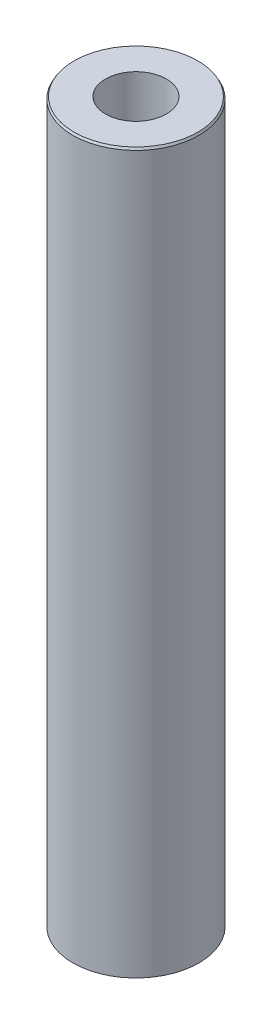
ISO-10303-21;
HEADER;
FILE_DESCRIPTION(('STEP AP214'),'2;1');
FILE_NAME('part.step','',(''),(''),'','','');
FILE_SCHEMA(('AUTOMOTIVE_DESIGN { 1 0 10303 214 1 1 1 1 }'));
ENDSEC;
DATA;
#1=APPLICATION_CONTEXT('core data for automotive mechanical design processes');
#2=APPLICATION_PROTOCOL_DEFINITION('international standard','automotive_design',2000,#1);
#3=PRODUCT_CONTEXT('',#1,'mechanical');
#4=PRODUCT('Part','Part','',(#3));
#5=PRODUCT_RELATED_PRODUCT_CATEGORY('part','',(#4));
#6=PRODUCT_DEFINITION_FORMATION('','',#4);
#7=PRODUCT_DEFINITION_CONTEXT('part definition',#1,'design');
#8=PRODUCT_DEFINITION('design','',#6,#7);
#9=PRODUCT_DEFINITION_SHAPE('','',#8);
#10=(LENGTH_UNIT() NAMED_UNIT(*) SI_UNIT(.MILLI.,.METRE.));
#11=(NAMED_UNIT(*) PLANE_ANGLE_UNIT() SI_UNIT($,.RADIAN.));
#12=(NAMED_UNIT(*) SI_UNIT($,.STERADIAN.) SOLID_ANGLE_UNIT());
#13=UNCERTAINTY_MEASURE_WITH_UNIT(LENGTH_MEASURE(1.E-05),#10,'distance_accuracy_value','');
#14=(GEOMETRIC_REPRESENTATION_CONTEXT(3) GLOBAL_UNCERTAINTY_ASSIGNED_CONTEXT((#13)) GLOBAL_UNIT_ASSIGNED_CONTEXT((#10,
#11,#12)) REPRESENTATION_CONTEXT('',''));
#15=CARTESIAN_POINT('',(0.,0.,0.));
#16=DIRECTION('',(0.,0.,1.));
#17=DIRECTION('',(1.,0.,0.));
#18=AXIS2_PLACEMENT_3D('',#15,#16,#17);
#19=CARTESIAN_POINT('',(0.,513.737910442329,0.));
#20=DIRECTION('',(0.,-1.,0.));
#21=DIRECTION('',(0.,0.,-1.));
#22=AXIS2_PLACEMENT_3D('',#19,#20,#21);
#23=CYLINDRICAL_SURFACE('',#22,45.);
#24=CARTESIAN_POINT('',(0.,512.237375210827,0.));
#25=DIRECTION('',(0.,1.,0.));
#26=DIRECTION('',(0.,0.,1.));
#27=AXIS2_PLACEMENT_3D('',#24,#25,#26);
#28=CIRCLE('',#27,45.);
#29=CARTESIAN_POINT('',(0.,512.237375210827,45.));
#30=VERTEX_POINT('',#29);
#31=EDGE_CURVE('E50',#30,#30,#28,.F.);
#32=ORIENTED_EDGE('',*,*,#31,.T.);
#33=EDGE_LOOP('',(#32));
#34=FACE_BOUND('',#33,.T.);
#35=CARTESIAN_POINT('',(0.,0.866334419836079,0.));
#36=DIRECTION('',(0.,1.,0.));
#37=DIRECTION('',(0.,0.,1.));
#38=AXIS2_PLACEMENT_3D('',#35,#36,#37);
#39=CIRCLE('',#38,45.);
#40=CARTESIAN_POINT('',(0.,0.866334419836079,45.));
#41=VERTEX_POINT('',#40);
#42=EDGE_CURVE('E51',#41,#41,#39,.T.);
#43=ORIENTED_EDGE('',*,*,#42,.T.);
#44=EDGE_LOOP('',(#43));
#45=FACE_BOUND('',#44,.T.);
#46=ADVANCED_FACE('F39',(#34,#45),#23,.T.);
#47=CARTESIAN_POINT('',(0.,513.737910442329,0.));
#48=DIRECTION('',(0.,1.,0.));
#49=DIRECTION('',(0.,0.,1.));
#50=AXIS2_PLACEMENT_3D('',#47,#48,#49);
#51=PLANE('',#50);
#52=CARTESIAN_POINT('',(0.,513.737910442329,0.));
#53=DIRECTION('',(0.,1.,0.));
#54=DIRECTION('',(0.,0.,1.));
#55=AXIS2_PLACEMENT_3D('',#52,#53,#54);
#56=CIRCLE('',#55,44.1336655801638);
#57=CARTESIAN_POINT('',(0.,513.737910442329,44.1336655801638));
#58=VERTEX_POINT('',#57);
#59=EDGE_CURVE('E54',#58,#58,#56,.T.);
#60=ORIENTED_EDGE('',*,*,#59,.T.);
#61=EDGE_LOOP('',(#60));
#62=FACE_BOUND('',#61,.T.);
#63=CARTESIAN_POINT('',(0.,513.737910442329,0.));
#64=DIRECTION('',(0.,1.,0.));
#65=DIRECTION('',(0.,0.,1.));
#66=AXIS2_PLACEMENT_3D('',#63,#64,#65);
#67=CIRCLE('',#66,21.717017062831);
#68=CARTESIAN_POINT('',(0.,513.737910442329,21.717017062831));
#69=VERTEX_POINT('',#68);
#70=EDGE_CURVE('E58',#69,#69,#67,.T.);
#71=ORIENTED_EDGE('',*,*,#70,.F.);
#72=EDGE_LOOP('',(#71));
#73=FACE_BOUND('',#72,.T.);
#74=ADVANCED_FACE('F69',(#62,#73),#51,.T.);
#75=CARTESIAN_POINT('',(0.,0.,0.));
#76=DIRECTION('',(0.,1.,0.));
#77=DIRECTION('',(0.,0.,1.));
#78=AXIS2_PLACEMENT_3D('',#75,#76,#77);
#79=PLANE('',#78);
#80=CARTESIAN_POINT('',(0.,0.,0.));
#81=DIRECTION('',(0.,1.,0.));
#82=DIRECTION('',(0.,0.,1.));
#83=AXIS2_PLACEMENT_3D('',#80,#81,#82);
#84=CIRCLE('',#83,43.4994647684981);
#85=CARTESIAN_POINT('',(0.,0.,43.4994647684981));
#86=VERTEX_POINT('',#85);
#87=EDGE_CURVE('E10',#86,#86,#84,.F.);
#88=ORIENTED_EDGE('',*,*,#87,.T.);
#89=EDGE_LOOP('',(#88));
#90=FACE_BOUND('',#89,.T.);
#91=CARTESIAN_POINT('',(0.,0.,0.));
#92=DIRECTION('',(0.,1.,0.));
#93=DIRECTION('',(0.,0.,1.));
#94=AXIS2_PLACEMENT_3D('',#91,#92,#93);
#95=CIRCLE('',#94,21.717017062831);
#96=CARTESIAN_POINT('',(0.,0.,21.717017062831));
#97=VERTEX_POINT('',#96);
#98=EDGE_CURVE('E63',#97,#97,#95,.T.);
#99=ORIENTED_EDGE('',*,*,#98,.T.);
#100=EDGE_LOOP('',(#99));
#101=FACE_BOUND('',#100,.T.);
#102=ADVANCED_FACE('F75',(#90,#101),#79,.F.);
#103=CARTESIAN_POINT('',(0.,513.737910442329,0.));
#104=DIRECTION('',(0.,-1.,0.));
#105=DIRECTION('',(0.,0.,-1.));
#106=AXIS2_PLACEMENT_3D('',#103,#104,#105);
#107=CYLINDRICAL_SURFACE('',#106,21.717017062831);
#108=ORIENTED_EDGE('',*,*,#70,.T.);
#109=EDGE_LOOP('',(#108));
#110=FACE_BOUND('',#109,.T.);
#111=ORIENTED_EDGE('',*,*,#98,.F.);
#112=EDGE_LOOP('',(#111));
#113=FACE_BOUND('',#112,.T.);
#114=ADVANCED_FACE('F70',(#110,#113),#107,.F.);
#115=CARTESIAN_POINT('',(0.,513.737910442329,0.));
#116=DIRECTION('',(0.,-1.,0.));
#117=DIRECTION('',(0.,0.,-1.));
#118=AXIS2_PLACEMENT_3D('',#115,#116,#117);
#119=CONICAL_SURFACE('',#118,44.1336655801638,0.523598775598287);
#120=ORIENTED_EDGE('',*,*,#31,.F.);
#121=EDGE_LOOP('',(#120));
#122=FACE_BOUND('',#121,.T.);
#123=ORIENTED_EDGE('',*,*,#59,.F.);
#124=EDGE_LOOP('',(#123));
#125=FACE_BOUND('',#124,.T.);
#126=ADVANCED_FACE('F81',(#122,#125),#119,.T.);
#127=CARTESIAN_POINT('',(0.,0.866334419836079,0.));
#128=DIRECTION('',(0.,1.,0.));
#129=DIRECTION('',(0.,0.,1.));
#130=AXIS2_PLACEMENT_3D('',#127,#128,#129);
#131=CONICAL_SURFACE('',#130,45.,1.04719755119662);
#132=CARTESIAN_POINT('',(0.,0.,43.4994647684981));
#133=CARTESIAN_POINT('',(0.,0.00902431687329237,43.5150953438263));
#134=CARTESIAN_POINT('',(0.,0.0180486337465849,43.5307259191544));
#135=CARTESIAN_POINT('',(0.,0.0360972674931698,43.5619870698107));
#136=CARTESIAN_POINT('',(0.,0.0451215843664623,43.5776176451389));
#137=CARTESIAN_POINT('',(0.,0.0631702181130473,43.6088787957951));
#138=CARTESIAN_POINT('',(0.,0.0721945349863398,43.6245093711233));
#139=CARTESIAN_POINT('',(0.,0.0902431687329248,43.6557705217796));
#140=CARTESIAN_POINT('',(0.,0.0992674856062173,43.6714010971077));
#141=CARTESIAN_POINT('',(0.,0.117316119352802,43.702662247764));
#142=CARTESIAN_POINT('',(0.,0.126340436226095,43.7182928230922));
#143=CARTESIAN_POINT('',(0.,0.14438906997268,43.7495539737484));
#144=CARTESIAN_POINT('',(0.,0.153413386845973,43.7651845490766));
#145=CARTESIAN_POINT('',(0.,0.171462020592558,43.7964456997329));
#146=CARTESIAN_POINT('',(0.,0.180486337465849,43.812076275061));
#147=CARTESIAN_POINT('',(0.,0.198534971212434,43.8433374257173));
#148=CARTESIAN_POINT('',(0.,0.207559288085727,43.8589680010455));
#149=CARTESIAN_POINT('',(0.,0.225607921832312,43.8902291517018));
#150=CARTESIAN_POINT('',(0.,0.234632238705605,43.9058597270299));
#151=CARTESIAN_POINT('',(0.,0.25268087245219,43.9371208776862));
#152=CARTESIAN_POINT('',(0.,0.261705189325482,43.9527514530143));
#153=CARTESIAN_POINT('',(0.,0.279753823072067,43.9840126036706));
#154=CARTESIAN_POINT('',(0.,0.28877813994536,43.9996431789988));
#155=CARTESIAN_POINT('',(0.,0.306826773691944,44.0309043296551));
#156=CARTESIAN_POINT('',(0.,0.315851090565237,44.0465349049832));
#157=CARTESIAN_POINT('',(0.,0.333899724311822,44.0777960556395));
#158=CARTESIAN_POINT('',(0.,0.342924041185114,44.0934266309676));
#159=CARTESIAN_POINT('',(0.,0.360972674931699,44.1246877816239));
#160=CARTESIAN_POINT('',(0.,0.369996991804992,44.1403183569521));
#161=CARTESIAN_POINT('',(0.,0.388045625551577,44.1715795076083));
#162=CARTESIAN_POINT('',(0.,0.397069942424869,44.1872100829365));
#163=CARTESIAN_POINT('',(0.,0.415118576171455,44.2184712335928));
#164=CARTESIAN_POINT('',(0.,0.424142893044748,44.2341018089209));
#165=CARTESIAN_POINT('',(0.,0.442191526791332,44.2653629595772));
#166=CARTESIAN_POINT('',(0.,0.451215843664624,44.2809935349054));
#167=CARTESIAN_POINT('',(0.,0.469264477411209,44.3122546855617));
#168=CARTESIAN_POINT('',(0.,0.478288794284502,44.3278852608898));
#169=CARTESIAN_POINT('',(0.,0.496337428031087,44.3591464115461));
#170=CARTESIAN_POINT('',(0.,0.505361744904379,44.3747769868742));
#171=CARTESIAN_POINT('',(0.,0.523410378650964,44.4060381375305));
#172=CARTESIAN_POINT('',(0.,0.532434695524257,44.4216687128587));
#173=CARTESIAN_POINT('',(0.,0.550483329270842,44.4529298635149));
#174=CARTESIAN_POINT('',(0.,0.559507646144134,44.4685604388431));
#175=CARTESIAN_POINT('',(0.,0.577556279890719,44.4998215894994));
#176=CARTESIAN_POINT('',(0.,0.586580596764012,44.5154521648275));
#177=CARTESIAN_POINT('',(0.,0.604629230510597,44.5467133154838));
#178=CARTESIAN_POINT('',(0.,0.613653547383889,44.562343890812));
#179=CARTESIAN_POINT('',(0.,0.631702181130474,44.5936050414682));
#180=CARTESIAN_POINT('',(0.,0.640726498003767,44.6092356167964));
#181=CARTESIAN_POINT('',(0.,0.658775131750352,44.6404967674527));
#182=CARTESIAN_POINT('',(0.,0.667799448623644,44.6561273427808));
#183=CARTESIAN_POINT('',(0.,0.685848082370229,44.6873884934371));
#184=CARTESIAN_POINT('',(0.,0.694872399243521,44.7030190687653));
#185=CARTESIAN_POINT('',(0.,0.712921032990107,44.7342802194215));
#186=CARTESIAN_POINT('',(0.,0.7219453498634,44.7499107947497));
#187=CARTESIAN_POINT('',(0.,0.739993983609984,44.781171945406));
#188=CARTESIAN_POINT('',(0.,0.749018300483276,44.7968025207341));
#189=CARTESIAN_POINT('',(0.,0.767066934229861,44.8280636713904));
#190=CARTESIAN_POINT('',(0.,0.776091251103154,44.8436942467186));
#191=CARTESIAN_POINT('',(0.,0.794139884849739,44.8749553973748));
#192=CARTESIAN_POINT('',(0.,0.803164201723031,44.890585972703));
#193=CARTESIAN_POINT('',(0.,0.821212835469616,44.9218471233593));
#194=CARTESIAN_POINT('',(0.,0.830237152342909,44.9374776986874));
#195=CARTESIAN_POINT('',(0.,0.848285786089494,44.9687388493437));
#196=CARTESIAN_POINT('',(0.,0.857310102962786,44.9843694246719));
#197=CARTESIAN_POINT('',(0.,0.866334419836079,45.));
#198=B_SPLINE_CURVE_WITH_KNOTS('',3,(#132,#133,#134,#135,#136,#137,#138,#139,#140,#141,#142,
#143,#144,#145,#146,#147,#148,#149,#150,#151,#152,#153,#154,#155,#156,#157,#158,#159,#160,#161,
#162,#163,#164,#165,#166,#167,#168,#169,#170,#171,#172,#173,#174,#175,#176,#177,#178,#179,#180,
#181,#182,#183,#184,#185,#186,#187,#188,#189,#190,#191,#192,#193,#194,#195,#196,#197),
.UNSPECIFIED.,.F.,.F.,(4,2,2,2,2,2,2,2,2,2,2,2,2,2,2,2,2,2,2,2,2,2,2,2,2,2,2,2,2,2,2,2,4),(0.,
0.0541459012397562,0.108291802479512,0.162437703719269,0.216583604959025,0.270729506198781,
0.324875407438537,0.3790213086783,0.433167209918056,0.487313111157812,0.541459012397568,
0.595604913637324,0.649750814877081,0.703896716116837,0.758042617356593,0.812188518596349,
0.866334419836106,0.920480321075868,0.974626222315624,1.02877212355538,1.08291802479514,
1.13706392603489,1.19120982727465,1.24535572851441,1.29950162975416,1.35364753099392,
1.40779343223367,1.46193933347343,1.51608523471319,1.57023113595295,1.62437703719271,
1.67852293843246,1.73266883967222),.UNSPECIFIED.);
#199=EDGE_CURVE('BSEAM45',#86,#41,#198,.T.);
#200=ORIENTED_EDGE('',*,*,#87,.F.);
#201=ORIENTED_EDGE('',*,*,#42,.F.);
#202=ORIENTED_EDGE('',*,*,#199,.T.);
#203=ORIENTED_EDGE('',*,*,#199,.F.);
#204=EDGE_LOOP('',(#200,#202,#201,#203));
#205=FACE_BOUND('',#204,.T.);
#206=ADVANCED_FACE('F45',(#205),#131,.T.);
#207=CLOSED_SHELL('',(#46,#74,#102,#114,#126,#206));
#208=MANIFOLD_SOLID_BREP('B2',#207);
#209=ADVANCED_BREP_SHAPE_REPRESENTATION('',(#18,#208),#14);
#210=SHAPE_DEFINITION_REPRESENTATION(#9,#209);
ENDSEC;
END-ISO-10303-21;
